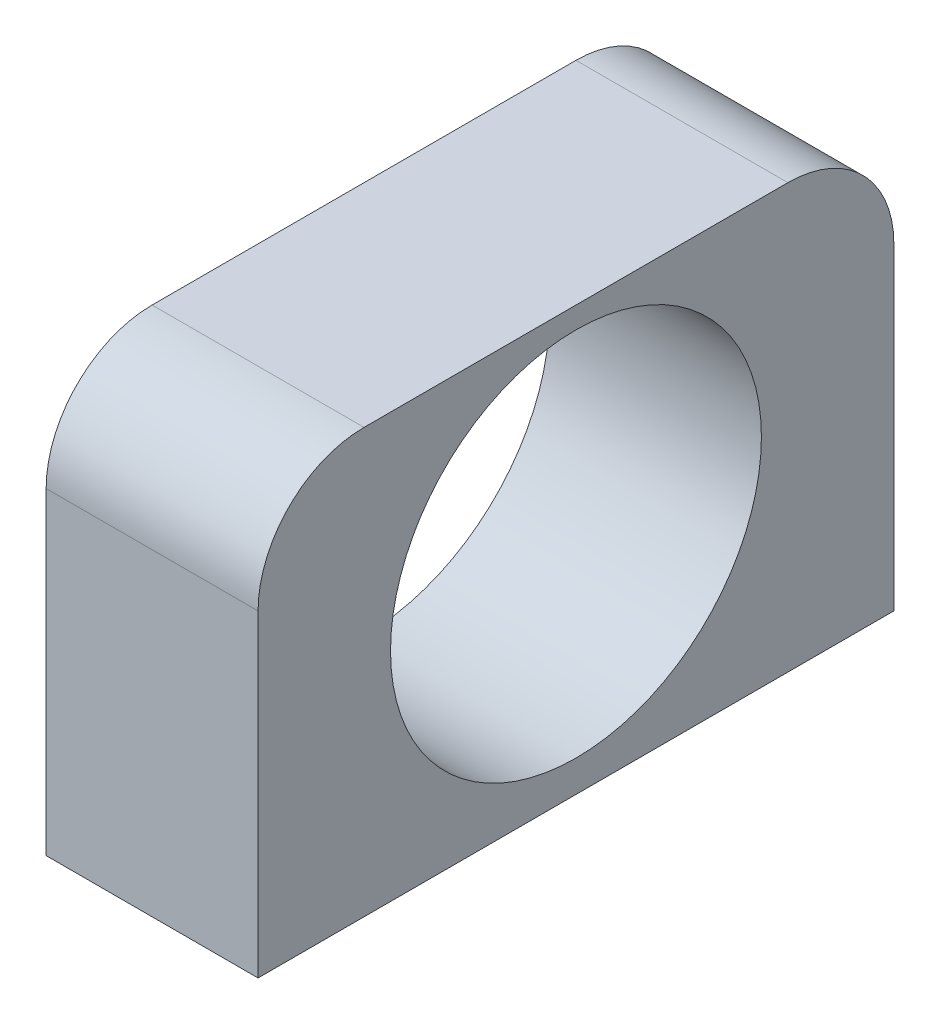
ISO-10303-21;
HEADER;
FILE_DESCRIPTION(('STEP AP214'),'2;1');
FILE_NAME('part.step','',(''),(''),'','','');
FILE_SCHEMA(('AUTOMOTIVE_DESIGN { 1 0 10303 214 1 1 1 1 }'));
ENDSEC;
DATA;
#1=APPLICATION_CONTEXT('core data for automotive mechanical design processes');
#2=APPLICATION_PROTOCOL_DEFINITION('international standard','automotive_design',2000,#1);
#3=PRODUCT_CONTEXT('',#1,'mechanical');
#4=PRODUCT('Part','Part','',(#3));
#5=PRODUCT_RELATED_PRODUCT_CATEGORY('part','',(#4));
#6=PRODUCT_DEFINITION_FORMATION('','',#4);
#7=PRODUCT_DEFINITION_CONTEXT('part definition',#1,'design');
#8=PRODUCT_DEFINITION('design','',#6,#7);
#9=PRODUCT_DEFINITION_SHAPE('','',#8);
#10=(LENGTH_UNIT() NAMED_UNIT(*) SI_UNIT(.MILLI.,.METRE.));
#11=(NAMED_UNIT(*) PLANE_ANGLE_UNIT() SI_UNIT($,.RADIAN.));
#12=(NAMED_UNIT(*) SI_UNIT($,.STERADIAN.) SOLID_ANGLE_UNIT());
#13=UNCERTAINTY_MEASURE_WITH_UNIT(LENGTH_MEASURE(1.E-05),#10,'distance_accuracy_value','');
#14=(GEOMETRIC_REPRESENTATION_CONTEXT(3) GLOBAL_UNCERTAINTY_ASSIGNED_CONTEXT((#13)) GLOBAL_UNIT_ASSIGNED_CONTEXT((#10,
#11,#12)) REPRESENTATION_CONTEXT('',''));
#15=CARTESIAN_POINT('',(0.,0.,0.));
#16=DIRECTION('',(0.,0.,1.));
#17=DIRECTION('',(1.,0.,0.));
#18=AXIS2_PLACEMENT_3D('',#15,#16,#17);
#19=CARTESIAN_POINT('',(6.35,25.4,19.05));
#20=DIRECTION('',(-1.,0.,0.));
#21=DIRECTION('',(0.,0.,1.));
#22=AXIS2_PLACEMENT_3D('',#19,#20,#21);
#23=PLANE('',#22);
#24=CARTESIAN_POINT('',(6.35,13.,0.));
#25=DIRECTION('',(-1.,0.,0.));
#26=DIRECTION('',(0.,0.,1.));
#27=AXIS2_PLACEMENT_3D('',#24,#25,#26);
#28=CIRCLE('',#27,11.1125);
#29=CARTESIAN_POINT('',(6.35,13.,11.1125));
#30=VERTEX_POINT('',#29);
#31=EDGE_CURVE('E118',#30,#30,#28,.T.);
#32=ORIENTED_EDGE('',*,*,#31,.T.);
#33=EDGE_LOOP('',(#32));
#34=FACE_BOUND('',#33,.T.);
#35=DIRECTION('',(0.,-1.,0.));
#36=VECTOR('',#35,1.);
#37=CARTESIAN_POINT('',(6.35,25.4,-19.05));
#38=LINE('',#37,#36);
#39=CARTESIAN_POINT('',(6.35,19.05,-19.05));
#40=VERTEX_POINT('',#39);
#41=CARTESIAN_POINT('',(6.35,0.,-19.05));
#42=VERTEX_POINT('',#41);
#43=EDGE_CURVE('E95',#40,#42,#38,.T.);
#44=ORIENTED_EDGE('',*,*,#43,.F.);
#45=CARTESIAN_POINT('',(6.35,19.05,-12.7));
#46=DIRECTION('',(-1.,0.,0.));
#47=DIRECTION('',(0.,0.,1.));
#48=AXIS2_PLACEMENT_3D('',#45,#46,#47);
#49=CIRCLE('',#48,6.35);
#50=CARTESIAN_POINT('',(6.35,25.4,-12.7));
#51=VERTEX_POINT('',#50);
#52=EDGE_CURVE('E52',#40,#51,#49,.F.);
#53=ORIENTED_EDGE('',*,*,#52,.T.);
#54=DIRECTION('',(0.,0.,-1.));
#55=VECTOR('',#54,1.);
#56=CARTESIAN_POINT('',(6.35,25.4,19.05));
#57=LINE('',#56,#55);
#58=CARTESIAN_POINT('',(6.35,25.4,12.7));
#59=VERTEX_POINT('',#58);
#60=EDGE_CURVE('E133',#59,#51,#57,.T.);
#61=ORIENTED_EDGE('',*,*,#60,.F.);
#62=CARTESIAN_POINT('',(6.35,19.05,12.7));
#63=DIRECTION('',(-1.,0.,0.));
#64=DIRECTION('',(0.,0.,1.));
#65=AXIS2_PLACEMENT_3D('',#62,#63,#64);
#66=CIRCLE('',#65,6.35);
#67=CARTESIAN_POINT('',(6.35,19.05,19.05));
#68=VERTEX_POINT('',#67);
#69=EDGE_CURVE('E59',#59,#68,#66,.F.);
#70=ORIENTED_EDGE('',*,*,#69,.T.);
#71=DIRECTION('',(0.,-1.,0.));
#72=VECTOR('',#71,1.);
#73=CARTESIAN_POINT('',(6.35,25.4,19.05));
#74=LINE('',#73,#72);
#75=CARTESIAN_POINT('',(6.35,0.,19.05));
#76=VERTEX_POINT('',#75);
#77=EDGE_CURVE('E115',#68,#76,#74,.T.);
#78=ORIENTED_EDGE('',*,*,#77,.T.);
#79=DIRECTION('',(0.,0.,-1.));
#80=VECTOR('',#79,1.);
#81=CARTESIAN_POINT('',(6.35,0.,19.05));
#82=LINE('',#81,#80);
#83=EDGE_CURVE('E110',#76,#42,#82,.T.);
#84=ORIENTED_EDGE('',*,*,#83,.T.);
#85=EDGE_LOOP('',(#44,#53,#61,#70,#78,#84));
#86=FACE_BOUND('',#85,.T.);
#87=ADVANCED_FACE('F43',(#34,#86),#23,.F.);
#88=CARTESIAN_POINT('',(-6.35,25.4,-19.05));
#89=DIRECTION('',(0.,0.,1.));
#90=DIRECTION('',(1.,0.,0.));
#91=AXIS2_PLACEMENT_3D('',#88,#89,#90);
#92=PLANE('',#91);
#93=DIRECTION('',(0.,-1.,0.));
#94=VECTOR('',#93,1.);
#95=CARTESIAN_POINT('',(-6.35,25.4,-19.05));
#96=LINE('',#95,#94);
#97=CARTESIAN_POINT('',(-6.35,19.05,-19.05));
#98=VERTEX_POINT('',#97);
#99=CARTESIAN_POINT('',(-6.35,0.,-19.05));
#100=VERTEX_POINT('',#99);
#101=EDGE_CURVE('E104',#98,#100,#96,.T.);
#102=ORIENTED_EDGE('',*,*,#101,.F.);
#103=DIRECTION('',(-1.,0.,0.));
#104=VECTOR('',#103,1.);
#105=CARTESIAN_POINT('',(-6.35,19.05,-19.05));
#106=LINE('',#105,#104);
#107=EDGE_CURVE('E67',#98,#40,#106,.F.);
#108=ORIENTED_EDGE('',*,*,#107,.T.);
#109=ORIENTED_EDGE('',*,*,#43,.T.);
#110=DIRECTION('',(-1.,0.,0.));
#111=VECTOR('',#110,1.);
#112=CARTESIAN_POINT('',(-6.35,0.,-19.05));
#113=LINE('',#112,#111);
#114=EDGE_CURVE('E98',#42,#100,#113,.T.);
#115=ORIENTED_EDGE('',*,*,#114,.T.);
#116=EDGE_LOOP('',(#102,#108,#109,#115));
#117=FACE_BOUND('',#116,.T.);
#118=ADVANCED_FACE('F97',(#117),#92,.F.);
#119=CARTESIAN_POINT('',(-6.35,25.4,19.05));
#120=DIRECTION('',(1.,0.,0.));
#121=DIRECTION('',(0.,0.,-1.));
#122=AXIS2_PLACEMENT_3D('',#119,#120,#121);
#123=PLANE('',#122);
#124=CARTESIAN_POINT('',(-6.35,13.,0.));
#125=DIRECTION('',(-1.,0.,0.));
#126=DIRECTION('',(0.,0.,1.));
#127=AXIS2_PLACEMENT_3D('',#124,#125,#126);
#128=CIRCLE('',#127,11.1125);
#129=CARTESIAN_POINT('',(-6.35,13.,11.1125));
#130=VERTEX_POINT('',#129);
#131=EDGE_CURVE('E122',#130,#130,#128,.T.);
#132=ORIENTED_EDGE('',*,*,#131,.F.);
#133=EDGE_LOOP('',(#132));
#134=FACE_BOUND('',#133,.T.);
#135=DIRECTION('',(0.,0.,1.));
#136=VECTOR('',#135,1.);
#137=CARTESIAN_POINT('',(-6.35,25.4,19.05));
#138=LINE('',#137,#136);
#139=CARTESIAN_POINT('',(-6.35,25.4,-12.7));
#140=VERTEX_POINT('',#139);
#141=CARTESIAN_POINT('',(-6.35,25.4,12.7));
#142=VERTEX_POINT('',#141);
#143=EDGE_CURVE('E125',#140,#142,#138,.T.);
#144=ORIENTED_EDGE('',*,*,#143,.F.);
#145=CARTESIAN_POINT('',(-6.35,19.05,-12.7));
#146=DIRECTION('',(1.,0.,0.));
#147=DIRECTION('',(0.,0.,-1.));
#148=AXIS2_PLACEMENT_3D('',#145,#146,#147);
#149=CIRCLE('',#148,6.35);
#150=EDGE_CURVE('E151',#140,#98,#149,.F.);
#151=ORIENTED_EDGE('',*,*,#150,.T.);
#152=ORIENTED_EDGE('',*,*,#101,.T.);
#153=DIRECTION('',(0.,0.,1.));
#154=VECTOR('',#153,1.);
#155=CARTESIAN_POINT('',(-6.35,0.,19.05));
#156=LINE('',#155,#154);
#157=CARTESIAN_POINT('',(-6.35,0.,19.05));
#158=VERTEX_POINT('',#157);
#159=EDGE_CURVE('E112',#100,#158,#156,.T.);
#160=ORIENTED_EDGE('',*,*,#159,.T.);
#161=DIRECTION('',(0.,-1.,0.));
#162=VECTOR('',#161,1.);
#163=CARTESIAN_POINT('',(-6.35,25.4,19.05));
#164=LINE('',#163,#162);
#165=CARTESIAN_POINT('',(-6.35,19.05,19.05));
#166=VERTEX_POINT('',#165);
#167=EDGE_CURVE('E136',#166,#158,#164,.T.);
#168=ORIENTED_EDGE('',*,*,#167,.F.);
#169=CARTESIAN_POINT('',(-6.35,19.05,12.7));
#170=DIRECTION('',(1.,0.,0.));
#171=DIRECTION('',(0.,0.,-1.));
#172=AXIS2_PLACEMENT_3D('',#169,#170,#171);
#173=CIRCLE('',#172,6.35);
#174=EDGE_CURVE('E148',#166,#142,#173,.F.);
#175=ORIENTED_EDGE('',*,*,#174,.T.);
#176=EDGE_LOOP('',(#144,#151,#152,#160,#168,#175));
#177=FACE_BOUND('',#176,.T.);
#178=ADVANCED_FACE('F169',(#134,#177),#123,.F.);
#179=CARTESIAN_POINT('',(-6.35,25.4,19.05));
#180=DIRECTION('',(0.,0.,-1.));
#181=DIRECTION('',(-1.,0.,0.));
#182=AXIS2_PLACEMENT_3D('',#179,#180,#181);
#183=PLANE('',#182);
#184=ORIENTED_EDGE('',*,*,#77,.F.);
#185=DIRECTION('',(1.,0.,0.));
#186=VECTOR('',#185,1.);
#187=CARTESIAN_POINT('',(-6.35,19.05,19.05));
#188=LINE('',#187,#186);
#189=EDGE_CURVE('E11',#68,#166,#188,.F.);
#190=ORIENTED_EDGE('',*,*,#189,.T.);
#191=ORIENTED_EDGE('',*,*,#167,.T.);
#192=DIRECTION('',(1.,0.,0.));
#193=VECTOR('',#192,1.);
#194=CARTESIAN_POINT('',(-6.35,0.,19.05));
#195=LINE('',#194,#193);
#196=EDGE_CURVE('E130',#158,#76,#195,.T.);
#197=ORIENTED_EDGE('',*,*,#196,.T.);
#198=EDGE_LOOP('',(#184,#190,#191,#197));
#199=FACE_BOUND('',#198,.T.);
#200=ADVANCED_FACE('F176',(#199),#183,.F.);
#201=CARTESIAN_POINT('',(0.,25.4,0.));
#202=DIRECTION('',(0.,-1.,0.));
#203=DIRECTION('',(0.,0.,-1.));
#204=AXIS2_PLACEMENT_3D('',#201,#202,#203);
#205=PLANE('',#204);
#206=ORIENTED_EDGE('',*,*,#60,.T.);
#207=DIRECTION('',(-1.,0.,0.));
#208=VECTOR('',#207,1.);
#209=CARTESIAN_POINT('',(0.,25.4,-12.7));
#210=LINE('',#209,#208);
#211=EDGE_CURVE('E144',#51,#140,#210,.T.);
#212=ORIENTED_EDGE('',*,*,#211,.T.);
#213=ORIENTED_EDGE('',*,*,#143,.T.);
#214=DIRECTION('',(1.,0.,0.));
#215=VECTOR('',#214,1.);
#216=CARTESIAN_POINT('',(0.,25.4,12.7));
#217=LINE('',#216,#215);
#218=EDGE_CURVE('E103',#142,#59,#217,.T.);
#219=ORIENTED_EDGE('',*,*,#218,.T.);
#220=EDGE_LOOP('',(#206,#212,#213,#219));
#221=FACE_BOUND('',#220,.T.);
#222=ADVANCED_FACE('F162',(#221),#205,.F.);
#223=CARTESIAN_POINT('',(0.,0.,0.));
#224=DIRECTION('',(0.,-1.,0.));
#225=DIRECTION('',(0.,0.,-1.));
#226=AXIS2_PLACEMENT_3D('',#223,#224,#225);
#227=PLANE('',#226);
#228=ORIENTED_EDGE('',*,*,#83,.F.);
#229=ORIENTED_EDGE('',*,*,#196,.F.);
#230=ORIENTED_EDGE('',*,*,#159,.F.);
#231=ORIENTED_EDGE('',*,*,#114,.F.);
#232=EDGE_LOOP('',(#228,#229,#230,#231));
#233=FACE_BOUND('',#232,.T.);
#234=ADVANCED_FACE('F108',(#233),#227,.T.);
#235=CARTESIAN_POINT('',(0.,19.05,-12.7));
#236=DIRECTION('',(-1.,0.,0.));
#237=DIRECTION('',(0.,0.,1.));
#238=AXIS2_PLACEMENT_3D('',#235,#236,#237);
#239=CYLINDRICAL_SURFACE('',#238,6.35);
#240=ORIENTED_EDGE('',*,*,#52,.F.);
#241=ORIENTED_EDGE('',*,*,#107,.F.);
#242=ORIENTED_EDGE('',*,*,#150,.F.);
#243=ORIENTED_EDGE('',*,*,#211,.F.);
#244=EDGE_LOOP('',(#240,#241,#242,#243));
#245=FACE_BOUND('',#244,.T.);
#246=ADVANCED_FACE('F167',(#245),#239,.T.);
#247=CARTESIAN_POINT('',(0.,19.05,12.7));
#248=DIRECTION('',(1.,0.,0.));
#249=DIRECTION('',(0.,0.,-1.));
#250=AXIS2_PLACEMENT_3D('',#247,#248,#249);
#251=CYLINDRICAL_SURFACE('',#250,6.35);
#252=ORIENTED_EDGE('',*,*,#174,.F.);
#253=ORIENTED_EDGE('',*,*,#189,.F.);
#254=ORIENTED_EDGE('',*,*,#69,.F.);
#255=ORIENTED_EDGE('',*,*,#218,.F.);
#256=EDGE_LOOP('',(#252,#253,#254,#255));
#257=FACE_BOUND('',#256,.T.);
#258=ADVANCED_FACE('F45',(#257),#251,.T.);
#259=CARTESIAN_POINT('',(6.35,13.,0.));
#260=DIRECTION('',(-1.,0.,0.));
#261=DIRECTION('',(0.,0.,1.));
#262=AXIS2_PLACEMENT_3D('',#259,#260,#261);
#263=CYLINDRICAL_SURFACE('',#262,11.1125);
#264=ORIENTED_EDGE('',*,*,#31,.F.);
#265=EDGE_LOOP('',(#264));
#266=FACE_BOUND('',#265,.T.);
#267=ORIENTED_EDGE('',*,*,#131,.T.);
#268=EDGE_LOOP('',(#267));
#269=FACE_BOUND('',#268,.T.);
#270=ADVANCED_FACE('F199',(#266,#269),#263,.F.);
#271=CLOSED_SHELL('',(#87,#118,#178,#200,#222,#234,#246,#258,#270));
#272=MANIFOLD_SOLID_BREP('B2',#271);
#273=ADVANCED_BREP_SHAPE_REPRESENTATION('',(#18,#272),#14);
#274=SHAPE_DEFINITION_REPRESENTATION(#9,#273);
ENDSEC;
END-ISO-10303-21;
